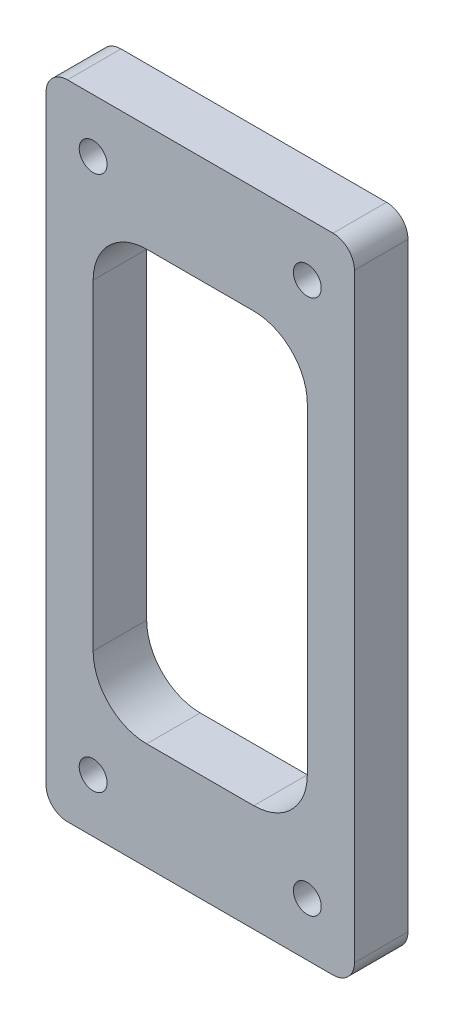
ISO-10303-21;
HEADER;
FILE_DESCRIPTION(('STEP AP214'),'2;1');
FILE_NAME('part.step','',(''),(''),'','','');
FILE_SCHEMA(('AUTOMOTIVE_DESIGN { 1 0 10303 214 1 1 1 1 }'));
ENDSEC;
DATA;
#1=APPLICATION_CONTEXT('core data for automotive mechanical design processes');
#2=APPLICATION_PROTOCOL_DEFINITION('international standard','automotive_design',2000,#1);
#3=PRODUCT_CONTEXT('',#1,'mechanical');
#4=PRODUCT('Part','Part','',(#3));
#5=PRODUCT_RELATED_PRODUCT_CATEGORY('part','',(#4));
#6=PRODUCT_DEFINITION_FORMATION('','',#4);
#7=PRODUCT_DEFINITION_CONTEXT('part definition',#1,'design');
#8=PRODUCT_DEFINITION('design','',#6,#7);
#9=PRODUCT_DEFINITION_SHAPE('','',#8);
#10=(LENGTH_UNIT() NAMED_UNIT(*) SI_UNIT(.MILLI.,.METRE.));
#11=(NAMED_UNIT(*) PLANE_ANGLE_UNIT() SI_UNIT($,.RADIAN.));
#12=(NAMED_UNIT(*) SI_UNIT($,.STERADIAN.) SOLID_ANGLE_UNIT());
#13=UNCERTAINTY_MEASURE_WITH_UNIT(LENGTH_MEASURE(1.E-05),#10,'distance_accuracy_value','');
#14=(GEOMETRIC_REPRESENTATION_CONTEXT(3) GLOBAL_UNCERTAINTY_ASSIGNED_CONTEXT((#13)) GLOBAL_UNIT_ASSIGNED_CONTEXT((#10,
#11,#12)) REPRESENTATION_CONTEXT('',''));
#15=CARTESIAN_POINT('',(0.,0.,0.));
#16=DIRECTION('',(0.,0.,1.));
#17=DIRECTION('',(1.,0.,0.));
#18=AXIS2_PLACEMENT_3D('',#15,#16,#17);
#19=CARTESIAN_POINT('',(14.4,30.,5.));
#20=DIRECTION('',(-1.,0.,0.));
#21=DIRECTION('',(0.,-1.,0.));
#22=AXIS2_PLACEMENT_3D('',#19,#20,#21);
#23=PLANE('',#22);
#24=DIRECTION('',(0.,1.,0.));
#25=VECTOR('',#24,1.);
#26=CARTESIAN_POINT('',(14.4,30.,5.));
#27=LINE('',#26,#25);
#28=CARTESIAN_POINT('',(14.4,-28.,5.));
#29=VERTEX_POINT('',#28);
#30=CARTESIAN_POINT('',(14.4,28.,5.));
#31=VERTEX_POINT('',#30);
#32=EDGE_CURVE('E251',#29,#31,#27,.T.);
#33=ORIENTED_EDGE('',*,*,#32,.F.);
#34=DIRECTION('',(0.,0.,-1.));
#35=VECTOR('',#34,1.);
#36=CARTESIAN_POINT('',(14.4,-28.,5.));
#37=LINE('',#36,#35);
#38=CARTESIAN_POINT('',(14.4,-28.,0.));
#39=VERTEX_POINT('',#38);
#40=EDGE_CURVE('E12',#29,#39,#37,.T.);
#41=ORIENTED_EDGE('',*,*,#40,.T.);
#42=DIRECTION('',(0.,1.,0.));
#43=VECTOR('',#42,1.);
#44=CARTESIAN_POINT('',(14.4,30.,0.));
#45=LINE('',#44,#43);
#46=CARTESIAN_POINT('',(14.4,28.,0.));
#47=VERTEX_POINT('',#46);
#48=EDGE_CURVE('E249',#39,#47,#45,.T.);
#49=ORIENTED_EDGE('',*,*,#48,.T.);
#50=DIRECTION('',(0.,0.,-1.));
#51=VECTOR('',#50,1.);
#52=CARTESIAN_POINT('',(14.4,28.,5.));
#53=LINE('',#52,#51);
#54=EDGE_CURVE('E58',#47,#31,#53,.F.);
#55=ORIENTED_EDGE('',*,*,#54,.T.);
#56=EDGE_LOOP('',(#33,#41,#49,#55));
#57=FACE_BOUND('',#56,.T.);
#58=ADVANCED_FACE('F50',(#57),#23,.F.);
#59=CARTESIAN_POINT('',(-14.4,30.,5.));
#60=DIRECTION('',(0.,-1.,0.));
#61=DIRECTION('',(0.,0.,-1.));
#62=AXIS2_PLACEMENT_3D('',#59,#60,#61);
#63=PLANE('',#62);
#64=DIRECTION('',(-1.,0.,0.));
#65=VECTOR('',#64,1.);
#66=CARTESIAN_POINT('',(-14.4,30.,0.));
#67=LINE('',#66,#65);
#68=CARTESIAN_POINT('',(12.4,30.,0.));
#69=VERTEX_POINT('',#68);
#70=CARTESIAN_POINT('',(-12.4,30.,0.));
#71=VERTEX_POINT('',#70);
#72=EDGE_CURVE('E267',#69,#71,#67,.T.);
#73=ORIENTED_EDGE('',*,*,#72,.T.);
#74=DIRECTION('',(0.,0.,-1.));
#75=VECTOR('',#74,1.);
#76=CARTESIAN_POINT('',(-12.4,30.,5.));
#77=LINE('',#76,#75);
#78=CARTESIAN_POINT('',(-12.4,30.,5.));
#79=VERTEX_POINT('',#78);
#80=EDGE_CURVE('E290',#71,#79,#77,.F.);
#81=ORIENTED_EDGE('',*,*,#80,.T.);
#82=DIRECTION('',(-1.,0.,0.));
#83=VECTOR('',#82,1.);
#84=CARTESIAN_POINT('',(-14.4,30.,5.));
#85=LINE('',#84,#83);
#86=CARTESIAN_POINT('',(12.4,30.,5.));
#87=VERTEX_POINT('',#86);
#88=EDGE_CURVE('E254',#87,#79,#85,.T.);
#89=ORIENTED_EDGE('',*,*,#88,.F.);
#90=DIRECTION('',(0.,0.,-1.));
#91=VECTOR('',#90,1.);
#92=CARTESIAN_POINT('',(12.4,30.,5.));
#93=LINE('',#92,#91);
#94=EDGE_CURVE('E287',#87,#69,#93,.T.);
#95=ORIENTED_EDGE('',*,*,#94,.T.);
#96=EDGE_LOOP('',(#73,#81,#89,#95));
#97=FACE_BOUND('',#96,.T.);
#98=ADVANCED_FACE('F318',(#97),#63,.F.);
#99=CARTESIAN_POINT('',(-14.4,30.,5.));
#100=DIRECTION('',(1.,0.,0.));
#101=DIRECTION('',(0.,1.,0.));
#102=AXIS2_PLACEMENT_3D('',#99,#100,#101);
#103=PLANE('',#102);
#104=DIRECTION('',(0.,-1.,0.));
#105=VECTOR('',#104,1.);
#106=CARTESIAN_POINT('',(-14.4,30.,5.));
#107=LINE('',#106,#105);
#108=CARTESIAN_POINT('',(-14.4,28.,5.));
#109=VERTEX_POINT('',#108);
#110=CARTESIAN_POINT('',(-14.4,-28.,5.));
#111=VERTEX_POINT('',#110);
#112=EDGE_CURVE('E258',#109,#111,#107,.T.);
#113=ORIENTED_EDGE('',*,*,#112,.F.);
#114=DIRECTION('',(0.,0.,-1.));
#115=VECTOR('',#114,1.);
#116=CARTESIAN_POINT('',(-14.4,28.,5.));
#117=LINE('',#116,#115);
#118=CARTESIAN_POINT('',(-14.4,28.,0.));
#119=VERTEX_POINT('',#118);
#120=EDGE_CURVE('E276',#109,#119,#117,.T.);
#121=ORIENTED_EDGE('',*,*,#120,.T.);
#122=DIRECTION('',(0.,-1.,0.));
#123=VECTOR('',#122,1.);
#124=CARTESIAN_POINT('',(-14.4,30.,0.));
#125=LINE('',#124,#123);
#126=CARTESIAN_POINT('',(-14.4,-28.,0.));
#127=VERTEX_POINT('',#126);
#128=EDGE_CURVE('E270',#119,#127,#125,.T.);
#129=ORIENTED_EDGE('',*,*,#128,.T.);
#130=DIRECTION('',(0.,0.,-1.));
#131=VECTOR('',#130,1.);
#132=CARTESIAN_POINT('',(-14.4,-28.,5.));
#133=LINE('',#132,#131);
#134=EDGE_CURVE('E264',#127,#111,#133,.F.);
#135=ORIENTED_EDGE('',*,*,#134,.T.);
#136=EDGE_LOOP('',(#113,#121,#129,#135));
#137=FACE_BOUND('',#136,.T.);
#138=ADVANCED_FACE('F328',(#137),#103,.F.);
#139=CARTESIAN_POINT('',(-14.4,-30.,5.));
#140=DIRECTION('',(0.,1.,0.));
#141=DIRECTION('',(0.,0.,1.));
#142=AXIS2_PLACEMENT_3D('',#139,#140,#141);
#143=PLANE('',#142);
#144=DIRECTION('',(1.,0.,0.));
#145=VECTOR('',#144,1.);
#146=CARTESIAN_POINT('',(-14.4,-30.,5.));
#147=LINE('',#146,#145);
#148=CARTESIAN_POINT('',(-12.4,-30.,5.));
#149=VERTEX_POINT('',#148);
#150=CARTESIAN_POINT('',(12.4,-30.,5.));
#151=VERTEX_POINT('',#150);
#152=EDGE_CURVE('E261',#149,#151,#147,.T.);
#153=ORIENTED_EDGE('',*,*,#152,.F.);
#154=DIRECTION('',(0.,0.,-1.));
#155=VECTOR('',#154,1.);
#156=CARTESIAN_POINT('',(-12.4,-30.,5.));
#157=LINE('',#156,#155);
#158=CARTESIAN_POINT('',(-12.4,-30.,0.));
#159=VERTEX_POINT('',#158);
#160=EDGE_CURVE('E302',#149,#159,#157,.T.);
#161=ORIENTED_EDGE('',*,*,#160,.T.);
#162=DIRECTION('',(1.,0.,0.));
#163=VECTOR('',#162,1.);
#164=CARTESIAN_POINT('',(-14.4,-30.,0.));
#165=LINE('',#164,#163);
#166=CARTESIAN_POINT('',(12.4,-30.,0.));
#167=VERTEX_POINT('',#166);
#168=EDGE_CURVE('E255',#159,#167,#165,.T.);
#169=ORIENTED_EDGE('',*,*,#168,.T.);
#170=DIRECTION('',(0.,0.,-1.));
#171=VECTOR('',#170,1.);
#172=CARTESIAN_POINT('',(12.4,-30.,5.));
#173=LINE('',#172,#171);
#174=EDGE_CURVE('E300',#167,#151,#173,.F.);
#175=ORIENTED_EDGE('',*,*,#174,.T.);
#176=EDGE_LOOP('',(#153,#161,#169,#175));
#177=FACE_BOUND('',#176,.T.);
#178=ADVANCED_FACE('F337',(#177),#143,.F.);
#179=CARTESIAN_POINT('',(0.,0.,5.));
#180=DIRECTION('',(0.,0.,1.));
#181=DIRECTION('',(1.,0.,0.));
#182=AXIS2_PLACEMENT_3D('',#179,#180,#181);
#183=PLANE('',#182);
#184=CARTESIAN_POINT('',(5.,15.,5.));
#185=DIRECTION('',(0.,0.,1.));
#186=DIRECTION('',(-1.,0.,0.));
#187=AXIS2_PLACEMENT_3D('',#184,#185,#186);
#188=CIRCLE('',#187,5.);
#189=CARTESIAN_POINT('',(10.,15.,5.));
#190=VERTEX_POINT('',#189);
#191=CARTESIAN_POINT('',(4.99999999999996,20.,5.));
#192=VERTEX_POINT('',#191);
#193=EDGE_CURVE('E65',#190,#192,#188,.T.);
#194=ORIENTED_EDGE('',*,*,#193,.F.);
#195=DIRECTION('',(0.,1.,0.));
#196=VECTOR('',#195,1.);
#197=CARTESIAN_POINT('',(10.,15.,5.));
#198=LINE('',#197,#196);
#199=CARTESIAN_POINT('',(10.,-15.,5.));
#200=VERTEX_POINT('',#199);
#201=EDGE_CURVE('E172',#200,#190,#198,.T.);
#202=ORIENTED_EDGE('',*,*,#201,.F.);
#203=CARTESIAN_POINT('',(5.,-15.,5.));
#204=DIRECTION('',(0.,0.,1.));
#205=DIRECTION('',(-1.,0.,0.));
#206=AXIS2_PLACEMENT_3D('',#203,#204,#205);
#207=CIRCLE('',#206,5.);
#208=CARTESIAN_POINT('',(4.99999999999996,-20.,5.));
#209=VERTEX_POINT('',#208);
#210=EDGE_CURVE('E211',#209,#200,#207,.T.);
#211=ORIENTED_EDGE('',*,*,#210,.F.);
#212=DIRECTION('',(1.,0.,0.));
#213=VECTOR('',#212,1.);
#214=CARTESIAN_POINT('',(4.99999999999996,-20.,5.));
#215=LINE('',#214,#213);
#216=CARTESIAN_POINT('',(-4.99999999999996,-20.,5.));
#217=VERTEX_POINT('',#216);
#218=EDGE_CURVE('E208',#217,#209,#215,.T.);
#219=ORIENTED_EDGE('',*,*,#218,.F.);
#220=CARTESIAN_POINT('',(-5.,-15.,5.));
#221=DIRECTION('',(0.,0.,1.));
#222=DIRECTION('',(1.,0.,0.));
#223=AXIS2_PLACEMENT_3D('',#220,#221,#222);
#224=CIRCLE('',#223,5.);
#225=CARTESIAN_POINT('',(-10.,-15.,5.));
#226=VERTEX_POINT('',#225);
#227=EDGE_CURVE('E205',#226,#217,#224,.T.);
#228=ORIENTED_EDGE('',*,*,#227,.F.);
#229=DIRECTION('',(0.,-1.,0.));
#230=VECTOR('',#229,1.);
#231=CARTESIAN_POINT('',(-10.,15.,5.));
#232=LINE('',#231,#230);
#233=CARTESIAN_POINT('',(-10.,15.,5.));
#234=VERTEX_POINT('',#233);
#235=EDGE_CURVE('E202',#234,#226,#232,.T.);
#236=ORIENTED_EDGE('',*,*,#235,.F.);
#237=CARTESIAN_POINT('',(-5.,15.,5.));
#238=DIRECTION('',(0.,0.,1.));
#239=DIRECTION('',(-1.,0.,0.));
#240=AXIS2_PLACEMENT_3D('',#237,#238,#239);
#241=CIRCLE('',#240,5.);
#242=CARTESIAN_POINT('',(-4.99999999999997,20.,5.));
#243=VERTEX_POINT('',#242);
#244=EDGE_CURVE('E199',#243,#234,#241,.T.);
#245=ORIENTED_EDGE('',*,*,#244,.F.);
#246=DIRECTION('',(-1.,0.,0.));
#247=VECTOR('',#246,1.);
#248=CARTESIAN_POINT('',(4.99999999999996,20.,5.));
#249=LINE('',#248,#247);
#250=EDGE_CURVE('E190',#192,#243,#249,.T.);
#251=ORIENTED_EDGE('',*,*,#250,.F.);
#252=EDGE_LOOP('',(#194,#202,#211,#219,#228,#236,#245,#251));
#253=FACE_BOUND('',#252,.T.);
#254=CARTESIAN_POINT('',(10.,25.,5.));
#255=DIRECTION('',(0.,0.,1.));
#256=DIRECTION('',(1.,0.,0.));
#257=AXIS2_PLACEMENT_3D('',#254,#255,#256);
#258=CIRCLE('',#257,1.29999999999999);
#259=CARTESIAN_POINT('',(11.3,25.,5.));
#260=VERTEX_POINT('',#259);
#261=EDGE_CURVE('E179',#260,#260,#258,.T.);
#262=ORIENTED_EDGE('',*,*,#261,.F.);
#263=EDGE_LOOP('',(#262));
#264=FACE_BOUND('',#263,.T.);
#265=CARTESIAN_POINT('',(10.,-25.,5.));
#266=DIRECTION('',(0.,0.,1.));
#267=DIRECTION('',(1.,0.,0.));
#268=AXIS2_PLACEMENT_3D('',#265,#266,#267);
#269=CIRCLE('',#268,1.29999999999999);
#270=CARTESIAN_POINT('',(11.3,-25.,5.));
#271=VERTEX_POINT('',#270);
#272=EDGE_CURVE('E236',#271,#271,#269,.T.);
#273=ORIENTED_EDGE('',*,*,#272,.F.);
#274=EDGE_LOOP('',(#273));
#275=FACE_BOUND('',#274,.T.);
#276=CARTESIAN_POINT('',(-10.,-25.,5.));
#277=DIRECTION('',(0.,0.,1.));
#278=DIRECTION('',(1.,0.,0.));
#279=AXIS2_PLACEMENT_3D('',#276,#277,#278);
#280=CIRCLE('',#279,1.29999999999999);
#281=CARTESIAN_POINT('',(-8.70000000000002,-25.,5.));
#282=VERTEX_POINT('',#281);
#283=EDGE_CURVE('E586',#282,#282,#280,.T.);
#284=ORIENTED_EDGE('',*,*,#283,.F.);
#285=EDGE_LOOP('',(#284));
#286=FACE_BOUND('',#285,.T.);
#287=CARTESIAN_POINT('',(-10.,25.,5.));
#288=DIRECTION('',(0.,0.,1.));
#289=DIRECTION('',(1.,0.,0.));
#290=AXIS2_PLACEMENT_3D('',#287,#288,#289);
#291=CIRCLE('',#290,1.29999999999999);
#292=CARTESIAN_POINT('',(-8.70000000000002,25.,5.));
#293=VERTEX_POINT('',#292);
#294=EDGE_CURVE('E250',#293,#293,#291,.T.);
#295=ORIENTED_EDGE('',*,*,#294,.F.);
#296=EDGE_LOOP('',(#295));
#297=FACE_BOUND('',#296,.T.);
#298=ORIENTED_EDGE('',*,*,#88,.T.);
#299=CARTESIAN_POINT('',(-12.4,28.,5.));
#300=DIRECTION('',(0.,0.,1.));
#301=DIRECTION('',(1.,0.,0.));
#302=AXIS2_PLACEMENT_3D('',#299,#300,#301);
#303=CIRCLE('',#302,2.);
#304=EDGE_CURVE('E298',#79,#109,#303,.T.);
#305=ORIENTED_EDGE('',*,*,#304,.T.);
#306=ORIENTED_EDGE('',*,*,#112,.T.);
#307=CARTESIAN_POINT('',(-12.4,-28.,5.));
#308=DIRECTION('',(0.,0.,1.));
#309=DIRECTION('',(1.,0.,0.));
#310=AXIS2_PLACEMENT_3D('',#307,#308,#309);
#311=CIRCLE('',#310,2.);
#312=EDGE_CURVE('E296',#111,#149,#311,.T.);
#313=ORIENTED_EDGE('',*,*,#312,.T.);
#314=ORIENTED_EDGE('',*,*,#152,.T.);
#315=CARTESIAN_POINT('',(12.4,-28.,5.));
#316=DIRECTION('',(0.,0.,1.));
#317=DIRECTION('',(1.,0.,0.));
#318=AXIS2_PLACEMENT_3D('',#315,#316,#317);
#319=CIRCLE('',#318,2.);
#320=EDGE_CURVE('E294',#151,#29,#319,.T.);
#321=ORIENTED_EDGE('',*,*,#320,.T.);
#322=ORIENTED_EDGE('',*,*,#32,.T.);
#323=CARTESIAN_POINT('',(12.4,28.,5.));
#324=DIRECTION('',(0.,0.,1.));
#325=DIRECTION('',(1.,0.,0.));
#326=AXIS2_PLACEMENT_3D('',#323,#324,#325);
#327=CIRCLE('',#326,2.);
#328=EDGE_CURVE('E292',#31,#87,#327,.T.);
#329=ORIENTED_EDGE('',*,*,#328,.T.);
#330=EDGE_LOOP('',(#298,#305,#306,#313,#314,#321,#322,#329));
#331=FACE_BOUND('',#330,.T.);
#332=ADVANCED_FACE('F312',(#253,#264,#275,#286,#297,#331),#183,.T.);
#333=CARTESIAN_POINT('',(0.,0.,0.));
#334=DIRECTION('',(0.,0.,1.));
#335=DIRECTION('',(1.,0.,0.));
#336=AXIS2_PLACEMENT_3D('',#333,#334,#335);
#337=PLANE('',#336);
#338=DIRECTION('',(0.,-1.,0.));
#339=VECTOR('',#338,1.);
#340=CARTESIAN_POINT('',(10.,15.,0.));
#341=LINE('',#340,#339);
#342=CARTESIAN_POINT('',(10.,15.,0.));
#343=VERTEX_POINT('',#342);
#344=CARTESIAN_POINT('',(10.,-15.,0.));
#345=VERTEX_POINT('',#344);
#346=EDGE_CURVE('E186',#343,#345,#341,.T.);
#347=ORIENTED_EDGE('',*,*,#346,.F.);
#348=CARTESIAN_POINT('',(5.,15.,0.));
#349=DIRECTION('',(0.,0.,1.));
#350=DIRECTION('',(1.,0.,0.));
#351=AXIS2_PLACEMENT_3D('',#348,#349,#350);
#352=CIRCLE('',#351,5.);
#353=CARTESIAN_POINT('',(4.99999999999996,20.,0.));
#354=VERTEX_POINT('',#353);
#355=EDGE_CURVE('E165',#354,#343,#352,.F.);
#356=ORIENTED_EDGE('',*,*,#355,.F.);
#357=DIRECTION('',(1.,0.,0.));
#358=VECTOR('',#357,1.);
#359=CARTESIAN_POINT('',(4.99999999999996,20.,0.));
#360=LINE('',#359,#358);
#361=CARTESIAN_POINT('',(-4.99999999999997,20.,0.));
#362=VERTEX_POINT('',#361);
#363=EDGE_CURVE('E175',#362,#354,#360,.T.);
#364=ORIENTED_EDGE('',*,*,#363,.F.);
#365=CARTESIAN_POINT('',(-5.,15.,0.));
#366=DIRECTION('',(0.,0.,1.));
#367=DIRECTION('',(1.,0.,0.));
#368=AXIS2_PLACEMENT_3D('',#365,#366,#367);
#369=CIRCLE('',#368,5.);
#370=CARTESIAN_POINT('',(-10.,15.,0.));
#371=VERTEX_POINT('',#370);
#372=EDGE_CURVE('E73',#371,#362,#369,.F.);
#373=ORIENTED_EDGE('',*,*,#372,.F.);
#374=DIRECTION('',(0.,1.,0.));
#375=VECTOR('',#374,1.);
#376=CARTESIAN_POINT('',(-10.,15.,0.));
#377=LINE('',#376,#375);
#378=CARTESIAN_POINT('',(-10.,-15.,0.));
#379=VERTEX_POINT('',#378);
#380=EDGE_CURVE('E559',#379,#371,#377,.T.);
#381=ORIENTED_EDGE('',*,*,#380,.F.);
#382=CARTESIAN_POINT('',(-5.,-15.,0.));
#383=DIRECTION('',(0.,0.,1.));
#384=DIRECTION('',(1.,0.,0.));
#385=AXIS2_PLACEMENT_3D('',#382,#383,#384);
#386=CIRCLE('',#385,5.);
#387=CARTESIAN_POINT('',(-4.99999999999996,-20.,0.));
#388=VERTEX_POINT('',#387);
#389=EDGE_CURVE('E562',#388,#379,#386,.F.);
#390=ORIENTED_EDGE('',*,*,#389,.F.);
#391=DIRECTION('',(-1.,0.,0.));
#392=VECTOR('',#391,1.);
#393=CARTESIAN_POINT('',(4.99999999999996,-20.,0.));
#394=LINE('',#393,#392);
#395=CARTESIAN_POINT('',(4.99999999999996,-20.,0.));
#396=VERTEX_POINT('',#395);
#397=EDGE_CURVE('E567',#396,#388,#394,.T.);
#398=ORIENTED_EDGE('',*,*,#397,.F.);
#399=CARTESIAN_POINT('',(5.,-15.,0.));
#400=DIRECTION('',(0.,0.,1.));
#401=DIRECTION('',(1.,0.,0.));
#402=AXIS2_PLACEMENT_3D('',#399,#400,#401);
#403=CIRCLE('',#402,5.);
#404=EDGE_CURVE('E193',#345,#396,#403,.F.);
#405=ORIENTED_EDGE('',*,*,#404,.F.);
#406=EDGE_LOOP('',(#347,#356,#364,#373,#381,#390,#398,#405));
#407=FACE_BOUND('',#406,.T.);
#408=CARTESIAN_POINT('',(10.,25.,0.));
#409=DIRECTION('',(0.,0.,1.));
#410=DIRECTION('',(1.,0.,0.));
#411=AXIS2_PLACEMENT_3D('',#408,#409,#410);
#412=CIRCLE('',#411,1.29999999999999);
#413=CARTESIAN_POINT('',(11.3,25.,0.));
#414=VERTEX_POINT('',#413);
#415=EDGE_CURVE('E231',#414,#414,#412,.T.);
#416=ORIENTED_EDGE('',*,*,#415,.T.);
#417=EDGE_LOOP('',(#416));
#418=FACE_BOUND('',#417,.T.);
#419=CARTESIAN_POINT('',(10.,-25.,0.));
#420=DIRECTION('',(0.,0.,1.));
#421=DIRECTION('',(1.,0.,0.));
#422=AXIS2_PLACEMENT_3D('',#419,#420,#421);
#423=CIRCLE('',#422,1.29999999999999);
#424=CARTESIAN_POINT('',(11.3,-25.,0.));
#425=VERTEX_POINT('',#424);
#426=EDGE_CURVE('E596',#425,#425,#423,.T.);
#427=ORIENTED_EDGE('',*,*,#426,.T.);
#428=EDGE_LOOP('',(#427));
#429=FACE_BOUND('',#428,.T.);
#430=CARTESIAN_POINT('',(-10.,-25.,0.));
#431=DIRECTION('',(0.,0.,1.));
#432=DIRECTION('',(1.,0.,0.));
#433=AXIS2_PLACEMENT_3D('',#430,#431,#432);
#434=CIRCLE('',#433,1.29999999999999);
#435=CARTESIAN_POINT('',(-8.70000000000002,-25.,0.));
#436=VERTEX_POINT('',#435);
#437=EDGE_CURVE('E590',#436,#436,#434,.T.);
#438=ORIENTED_EDGE('',*,*,#437,.T.);
#439=EDGE_LOOP('',(#438));
#440=FACE_BOUND('',#439,.T.);
#441=CARTESIAN_POINT('',(-10.,25.,0.));
#442=DIRECTION('',(0.,0.,1.));
#443=DIRECTION('',(1.,0.,0.));
#444=AXIS2_PLACEMENT_3D('',#441,#442,#443);
#445=CIRCLE('',#444,1.29999999999999);
#446=CARTESIAN_POINT('',(-8.70000000000002,25.,0.));
#447=VERTEX_POINT('',#446);
#448=EDGE_CURVE('E243',#447,#447,#445,.T.);
#449=ORIENTED_EDGE('',*,*,#448,.T.);
#450=EDGE_LOOP('',(#449));
#451=FACE_BOUND('',#450,.T.);
#452=ORIENTED_EDGE('',*,*,#128,.F.);
#453=CARTESIAN_POINT('',(-12.4,28.,0.));
#454=DIRECTION('',(0.,0.,1.));
#455=DIRECTION('',(1.,0.,0.));
#456=AXIS2_PLACEMENT_3D('',#453,#454,#455);
#457=CIRCLE('',#456,2.);
#458=EDGE_CURVE('E285',#119,#71,#457,.F.);
#459=ORIENTED_EDGE('',*,*,#458,.T.);
#460=ORIENTED_EDGE('',*,*,#72,.F.);
#461=CARTESIAN_POINT('',(12.4,28.,0.));
#462=DIRECTION('',(0.,0.,1.));
#463=DIRECTION('',(1.,0.,0.));
#464=AXIS2_PLACEMENT_3D('',#461,#462,#463);
#465=CIRCLE('',#464,2.);
#466=EDGE_CURVE('E279',#69,#47,#465,.F.);
#467=ORIENTED_EDGE('',*,*,#466,.T.);
#468=ORIENTED_EDGE('',*,*,#48,.F.);
#469=CARTESIAN_POINT('',(12.4,-28.,0.));
#470=DIRECTION('',(0.,0.,1.));
#471=DIRECTION('',(1.,0.,0.));
#472=AXIS2_PLACEMENT_3D('',#469,#470,#471);
#473=CIRCLE('',#472,2.);
#474=EDGE_CURVE('E281',#39,#167,#473,.F.);
#475=ORIENTED_EDGE('',*,*,#474,.T.);
#476=ORIENTED_EDGE('',*,*,#168,.F.);
#477=CARTESIAN_POINT('',(-12.4,-28.,0.));
#478=DIRECTION('',(0.,0.,1.));
#479=DIRECTION('',(1.,0.,0.));
#480=AXIS2_PLACEMENT_3D('',#477,#478,#479);
#481=CIRCLE('',#480,2.);
#482=EDGE_CURVE('E283',#159,#127,#481,.F.);
#483=ORIENTED_EDGE('',*,*,#482,.T.);
#484=EDGE_LOOP('',(#452,#459,#460,#467,#468,#475,#476,#483));
#485=FACE_BOUND('',#484,.T.);
#486=ADVANCED_FACE('F182',(#407,#418,#429,#440,#451,#485),#337,.F.);
#487=CARTESIAN_POINT('',(-12.4,28.,5.));
#488=DIRECTION('',(0.,0.,-1.));
#489=DIRECTION('',(-1.,0.,0.));
#490=AXIS2_PLACEMENT_3D('',#487,#488,#489);
#491=CYLINDRICAL_SURFACE('',#490,2.);
#492=ORIENTED_EDGE('',*,*,#304,.F.);
#493=ORIENTED_EDGE('',*,*,#80,.F.);
#494=ORIENTED_EDGE('',*,*,#458,.F.);
#495=ORIENTED_EDGE('',*,*,#120,.F.);
#496=EDGE_LOOP('',(#492,#493,#494,#495));
#497=FACE_BOUND('',#496,.T.);
#498=ADVANCED_FACE('F325',(#497),#491,.T.);
#499=CARTESIAN_POINT('',(-12.4,-28.,5.));
#500=DIRECTION('',(0.,0.,-1.));
#501=DIRECTION('',(-1.,0.,0.));
#502=AXIS2_PLACEMENT_3D('',#499,#500,#501);
#503=CYLINDRICAL_SURFACE('',#502,2.);
#504=ORIENTED_EDGE('',*,*,#312,.F.);
#505=ORIENTED_EDGE('',*,*,#134,.F.);
#506=ORIENTED_EDGE('',*,*,#482,.F.);
#507=ORIENTED_EDGE('',*,*,#160,.F.);
#508=EDGE_LOOP('',(#504,#505,#506,#507));
#509=FACE_BOUND('',#508,.T.);
#510=ADVANCED_FACE('F334',(#509),#503,.T.);
#511=CARTESIAN_POINT('',(12.4,-28.,5.));
#512=DIRECTION('',(0.,0.,-1.));
#513=DIRECTION('',(-1.,0.,0.));
#514=AXIS2_PLACEMENT_3D('',#511,#512,#513);
#515=CYLINDRICAL_SURFACE('',#514,2.);
#516=ORIENTED_EDGE('',*,*,#320,.F.);
#517=ORIENTED_EDGE('',*,*,#174,.F.);
#518=ORIENTED_EDGE('',*,*,#474,.F.);
#519=ORIENTED_EDGE('',*,*,#40,.F.);
#520=EDGE_LOOP('',(#516,#517,#518,#519));
#521=FACE_BOUND('',#520,.T.);
#522=ADVANCED_FACE('F340',(#521),#515,.T.);
#523=CARTESIAN_POINT('',(12.4,28.,5.));
#524=DIRECTION('',(0.,0.,-1.));
#525=DIRECTION('',(-1.,0.,0.));
#526=AXIS2_PLACEMENT_3D('',#523,#524,#525);
#527=CYLINDRICAL_SURFACE('',#526,2.);
#528=ORIENTED_EDGE('',*,*,#328,.F.);
#529=ORIENTED_EDGE('',*,*,#54,.F.);
#530=ORIENTED_EDGE('',*,*,#466,.F.);
#531=ORIENTED_EDGE('',*,*,#94,.F.);
#532=EDGE_LOOP('',(#528,#529,#530,#531));
#533=FACE_BOUND('',#532,.T.);
#534=ADVANCED_FACE('F52',(#533),#527,.T.);
#535=CARTESIAN_POINT('',(-10.,25.,5.));
#536=DIRECTION('',(0.,0.,1.));
#537=DIRECTION('',(1.,0.,0.));
#538=AXIS2_PLACEMENT_3D('',#535,#536,#537);
#539=CYLINDRICAL_SURFACE('',#538,1.29999999999999);
#540=ORIENTED_EDGE('',*,*,#448,.F.);
#541=EDGE_LOOP('',(#540));
#542=FACE_BOUND('',#541,.T.);
#543=ORIENTED_EDGE('',*,*,#294,.T.);
#544=EDGE_LOOP('',(#543));
#545=FACE_BOUND('',#544,.T.);
#546=ADVANCED_FACE('F346',(#542,#545),#539,.F.);
#547=CARTESIAN_POINT('',(-10.,-25.,5.));
#548=DIRECTION('',(0.,0.,1.));
#549=DIRECTION('',(1.,0.,0.));
#550=AXIS2_PLACEMENT_3D('',#547,#548,#549);
#551=CYLINDRICAL_SURFACE('',#550,1.29999999999999);
#552=ORIENTED_EDGE('',*,*,#437,.F.);
#553=EDGE_LOOP('',(#552));
#554=FACE_BOUND('',#553,.T.);
#555=ORIENTED_EDGE('',*,*,#283,.T.);
#556=EDGE_LOOP('',(#555));
#557=FACE_BOUND('',#556,.T.);
#558=ADVANCED_FACE('F408',(#554,#557),#551,.F.);
#559=CARTESIAN_POINT('',(10.,-25.,5.));
#560=DIRECTION('',(0.,0.,1.));
#561=DIRECTION('',(1.,0.,0.));
#562=AXIS2_PLACEMENT_3D('',#559,#560,#561);
#563=CYLINDRICAL_SURFACE('',#562,1.29999999999999);
#564=ORIENTED_EDGE('',*,*,#426,.F.);
#565=EDGE_LOOP('',(#564));
#566=FACE_BOUND('',#565,.T.);
#567=ORIENTED_EDGE('',*,*,#272,.T.);
#568=EDGE_LOOP('',(#567));
#569=FACE_BOUND('',#568,.T.);
#570=ADVANCED_FACE('F416',(#566,#569),#563,.F.);
#571=CARTESIAN_POINT('',(10.,25.,5.));
#572=DIRECTION('',(0.,0.,1.));
#573=DIRECTION('',(1.,0.,0.));
#574=AXIS2_PLACEMENT_3D('',#571,#572,#573);
#575=CYLINDRICAL_SURFACE('',#574,1.29999999999999);
#576=ORIENTED_EDGE('',*,*,#415,.F.);
#577=EDGE_LOOP('',(#576));
#578=FACE_BOUND('',#577,.T.);
#579=ORIENTED_EDGE('',*,*,#261,.T.);
#580=EDGE_LOOP('',(#579));
#581=FACE_BOUND('',#580,.T.);
#582=ADVANCED_FACE('F425',(#578,#581),#575,.F.);
#583=CARTESIAN_POINT('',(5.,15.,-0.00100000000000447));
#584=DIRECTION('',(0.,0.,1.));
#585=DIRECTION('',(1.,0.,0.));
#586=AXIS2_PLACEMENT_3D('',#583,#584,#585);
#587=CYLINDRICAL_SURFACE('',#586,5.);
#588=ORIENTED_EDGE('',*,*,#355,.T.);
#589=DIRECTION('',(0.,0.,1.));
#590=VECTOR('',#589,1.);
#591=CARTESIAN_POINT('',(10.,15.,-0.00100000000000447));
#592=LINE('',#591,#590);
#593=EDGE_CURVE('E180',#343,#190,#592,.T.);
#594=ORIENTED_EDGE('',*,*,#593,.T.);
#595=ORIENTED_EDGE('',*,*,#193,.T.);
#596=DIRECTION('',(0.,0.,1.));
#597=VECTOR('',#596,1.);
#598=CARTESIAN_POINT('',(4.99999999999996,20.,-0.00100000000000447));
#599=LINE('',#598,#597);
#600=EDGE_CURVE('E161',#354,#192,#599,.T.);
#601=ORIENTED_EDGE('',*,*,#600,.F.);
#602=EDGE_LOOP('',(#588,#594,#595,#601));
#603=FACE_BOUND('',#602,.T.);
#604=ADVANCED_FACE('F163',(#603),#587,.F.);
#605=CARTESIAN_POINT('',(10.,15.,-0.00100000000000447));
#606=DIRECTION('',(1.,0.,0.));
#607=DIRECTION('',(0.,1.,0.));
#608=AXIS2_PLACEMENT_3D('',#605,#606,#607);
#609=PLANE('',#608);
#610=ORIENTED_EDGE('',*,*,#346,.T.);
#611=DIRECTION('',(0.,0.,1.));
#612=VECTOR('',#611,1.);
#613=CARTESIAN_POINT('',(10.,-15.,-0.00100000000000447));
#614=LINE('',#613,#612);
#615=EDGE_CURVE('E217',#345,#200,#614,.T.);
#616=ORIENTED_EDGE('',*,*,#615,.T.);
#617=ORIENTED_EDGE('',*,*,#201,.T.);
#618=ORIENTED_EDGE('',*,*,#593,.F.);
#619=EDGE_LOOP('',(#610,#616,#617,#618));
#620=FACE_BOUND('',#619,.T.);
#621=ADVANCED_FACE('F440',(#620),#609,.F.);
#622=CARTESIAN_POINT('',(5.,-15.,-0.00100000000000447));
#623=DIRECTION('',(0.,0.,1.));
#624=DIRECTION('',(1.,0.,0.));
#625=AXIS2_PLACEMENT_3D('',#622,#623,#624);
#626=CYLINDRICAL_SURFACE('',#625,5.);
#627=ORIENTED_EDGE('',*,*,#404,.T.);
#628=DIRECTION('',(0.,0.,1.));
#629=VECTOR('',#628,1.);
#630=CARTESIAN_POINT('',(4.99999999999996,-20.,-0.00100000000000447));
#631=LINE('',#630,#629);
#632=EDGE_CURVE('E219',#396,#209,#631,.T.);
#633=ORIENTED_EDGE('',*,*,#632,.T.);
#634=ORIENTED_EDGE('',*,*,#210,.T.);
#635=ORIENTED_EDGE('',*,*,#615,.F.);
#636=EDGE_LOOP('',(#627,#633,#634,#635));
#637=FACE_BOUND('',#636,.T.);
#638=ADVANCED_FACE('F448',(#637),#626,.F.);
#639=CARTESIAN_POINT('',(4.99999999999996,-20.,-0.00100000000000447));
#640=DIRECTION('',(0.,-1.,0.));
#641=DIRECTION('',(0.,0.,-1.));
#642=AXIS2_PLACEMENT_3D('',#639,#640,#641);
#643=PLANE('',#642);
#644=ORIENTED_EDGE('',*,*,#397,.T.);
#645=DIRECTION('',(0.,0.,1.));
#646=VECTOR('',#645,1.);
#647=CARTESIAN_POINT('',(-4.99999999999996,-20.,-0.00100000000000447));
#648=LINE('',#647,#646);
#649=EDGE_CURVE('E222',#388,#217,#648,.T.);
#650=ORIENTED_EDGE('',*,*,#649,.T.);
#651=ORIENTED_EDGE('',*,*,#218,.T.);
#652=ORIENTED_EDGE('',*,*,#632,.F.);
#653=EDGE_LOOP('',(#644,#650,#651,#652));
#654=FACE_BOUND('',#653,.T.);
#655=ADVANCED_FACE('F457',(#654),#643,.F.);
#656=CARTESIAN_POINT('',(-5.,-15.,-0.00100000000000447));
#657=DIRECTION('',(0.,0.,1.));
#658=DIRECTION('',(1.,0.,0.));
#659=AXIS2_PLACEMENT_3D('',#656,#657,#658);
#660=CYLINDRICAL_SURFACE('',#659,5.);
#661=ORIENTED_EDGE('',*,*,#389,.T.);
#662=DIRECTION('',(0.,0.,1.));
#663=VECTOR('',#662,1.);
#664=CARTESIAN_POINT('',(-10.,-15.,-0.00100000000000447));
#665=LINE('',#664,#663);
#666=EDGE_CURVE('E224',#379,#226,#665,.T.);
#667=ORIENTED_EDGE('',*,*,#666,.T.);
#668=ORIENTED_EDGE('',*,*,#227,.T.);
#669=ORIENTED_EDGE('',*,*,#649,.F.);
#670=EDGE_LOOP('',(#661,#667,#668,#669));
#671=FACE_BOUND('',#670,.T.);
#672=ADVANCED_FACE('F466',(#671),#660,.F.);
#673=CARTESIAN_POINT('',(-10.,15.,-0.00100000000000447));
#674=DIRECTION('',(-1.,0.,0.));
#675=DIRECTION('',(0.,-1.,0.));
#676=AXIS2_PLACEMENT_3D('',#673,#674,#675);
#677=PLANE('',#676);
#678=ORIENTED_EDGE('',*,*,#380,.T.);
#679=DIRECTION('',(0.,0.,1.));
#680=VECTOR('',#679,1.);
#681=CARTESIAN_POINT('',(-10.,15.,-0.00100000000000447));
#682=LINE('',#681,#680);
#683=EDGE_CURVE('E226',#371,#234,#682,.T.);
#684=ORIENTED_EDGE('',*,*,#683,.T.);
#685=ORIENTED_EDGE('',*,*,#235,.T.);
#686=ORIENTED_EDGE('',*,*,#666,.F.);
#687=EDGE_LOOP('',(#678,#684,#685,#686));
#688=FACE_BOUND('',#687,.T.);
#689=ADVANCED_FACE('F475',(#688),#677,.F.);
#690=CARTESIAN_POINT('',(-5.,15.,-0.00100000000000447));
#691=DIRECTION('',(0.,0.,1.));
#692=DIRECTION('',(1.,0.,0.));
#693=AXIS2_PLACEMENT_3D('',#690,#691,#692);
#694=CYLINDRICAL_SURFACE('',#693,5.);
#695=ORIENTED_EDGE('',*,*,#372,.T.);
#696=DIRECTION('',(0.,0.,1.));
#697=VECTOR('',#696,1.);
#698=CARTESIAN_POINT('',(-4.99999999999997,20.,-0.00100000000000447));
#699=LINE('',#698,#697);
#700=EDGE_CURVE('E171',#362,#243,#699,.T.);
#701=ORIENTED_EDGE('',*,*,#700,.T.);
#702=ORIENTED_EDGE('',*,*,#244,.T.);
#703=ORIENTED_EDGE('',*,*,#683,.F.);
#704=EDGE_LOOP('',(#695,#701,#702,#703));
#705=FACE_BOUND('',#704,.T.);
#706=ADVANCED_FACE('F484',(#705),#694,.F.);
#707=CARTESIAN_POINT('',(4.99999999999996,20.,-0.00100000000000447));
#708=DIRECTION('',(0.,1.,0.));
#709=DIRECTION('',(-1.,0.,0.));
#710=AXIS2_PLACEMENT_3D('',#707,#708,#709);
#711=PLANE('',#710);
#712=ORIENTED_EDGE('',*,*,#363,.T.);
#713=ORIENTED_EDGE('',*,*,#600,.T.);
#714=ORIENTED_EDGE('',*,*,#250,.T.);
#715=ORIENTED_EDGE('',*,*,#700,.F.);
#716=EDGE_LOOP('',(#712,#713,#714,#715));
#717=FACE_BOUND('',#716,.T.);
#718=ADVANCED_FACE('F176',(#717),#711,.F.);
#719=CLOSED_SHELL('',(#58,#98,#138,#178,#332,#486,#498,#510,#522,#534,#546,#558,#570,#582,#604,
#621,#638,#655,#672,#689,#706,#718));
#720=MANIFOLD_SOLID_BREP('B2',#719);
#721=ADVANCED_BREP_SHAPE_REPRESENTATION('',(#18,#720),#14);
#722=SHAPE_DEFINITION_REPRESENTATION(#9,#721);
ENDSEC;
END-ISO-10303-21;
